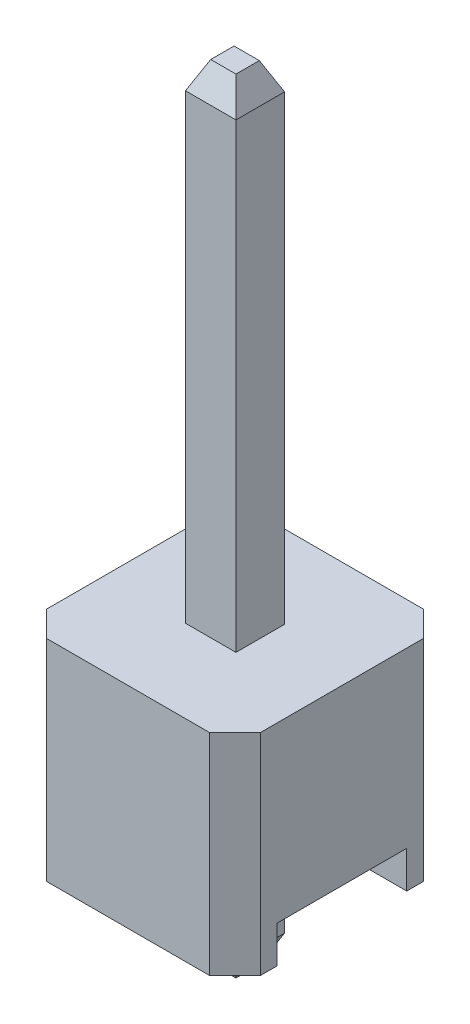
ISO-10303-21;
HEADER;
FILE_DESCRIPTION(('STEP AP214'),'2;1');
FILE_NAME('part.step','',(''),(''),'','','');
FILE_SCHEMA(('AUTOMOTIVE_DESIGN { 1 0 10303 214 1 1 1 1 }'));
ENDSEC;
DATA;
#1=APPLICATION_CONTEXT('core data for automotive mechanical design processes');
#2=APPLICATION_PROTOCOL_DEFINITION('international standard','automotive_design',2000,#1);
#3=PRODUCT_CONTEXT('',#1,'mechanical');
#4=PRODUCT('Part','Part','',(#3));
#5=PRODUCT_RELATED_PRODUCT_CATEGORY('part','',(#4));
#6=PRODUCT_DEFINITION_FORMATION('','',#4);
#7=PRODUCT_DEFINITION_CONTEXT('part definition',#1,'design');
#8=PRODUCT_DEFINITION('design','',#6,#7);
#9=PRODUCT_DEFINITION_SHAPE('','',#8);
#10=(LENGTH_UNIT() NAMED_UNIT(*) SI_UNIT(.MILLI.,.METRE.));
#11=(NAMED_UNIT(*) PLANE_ANGLE_UNIT() SI_UNIT($,.RADIAN.));
#12=(NAMED_UNIT(*) SI_UNIT($,.STERADIAN.) SOLID_ANGLE_UNIT());
#13=UNCERTAINTY_MEASURE_WITH_UNIT(LENGTH_MEASURE(1.E-05),#10,'distance_accuracy_value','');
#14=(GEOMETRIC_REPRESENTATION_CONTEXT(3) GLOBAL_UNCERTAINTY_ASSIGNED_CONTEXT((#13)) GLOBAL_UNIT_ASSIGNED_CONTEXT((#10,
#11,#12)) REPRESENTATION_CONTEXT('',''));
#15=CARTESIAN_POINT('',(0.,0.,0.));
#16=DIRECTION('',(0.,0.,1.));
#17=DIRECTION('',(1.,0.,0.));
#18=AXIS2_PLACEMENT_3D('',#15,#16,#17);
#19=CARTESIAN_POINT('',(15.6674969604626,-5.69124998633488,-0.267125953881934));
#20=DIRECTION('',(0.,-1.,0.));
#21=DIRECTION('',(0.,0.,-1.));
#22=AXIS2_PLACEMENT_3D('',#19,#20,#21);
#23=PLANE('',#22);
#24=DIRECTION('',(1.,0.,0.));
#25=VECTOR('',#24,1.);
#26=CARTESIAN_POINT('',(15.0674969604626,-5.69124998633488,-0.117125953881934));
#27=LINE('',#26,#25);
#28=CARTESIAN_POINT('',(15.2174969604626,-5.69124998633488,-0.117125953881935));
#29=VERTEX_POINT('',#28);
#30=CARTESIAN_POINT('',(15.5174969604626,-5.69124998633488,-0.117125953881935));
#31=VERTEX_POINT('',#30);
#32=EDGE_CURVE('E194',#29,#31,#27,.T.);
#33=ORIENTED_EDGE('',*,*,#32,.T.);
#34=DIRECTION('',(0.,0.,1.));
#35=VECTOR('',#34,1.);
#36=CARTESIAN_POINT('',(15.5174969604626,-5.69124998633488,-0.267125953881934));
#37=LINE('',#36,#35);
#38=CARTESIAN_POINT('',(15.5174969604626,-5.69124998633488,0.160380176225975));
#39=VERTEX_POINT('',#38);
#40=EDGE_CURVE('E179',#31,#39,#37,.T.);
#41=ORIENTED_EDGE('',*,*,#40,.T.);
#42=DIRECTION('',(1.,0.,0.));
#43=VECTOR('',#42,1.);
#44=CARTESIAN_POINT('',(15.6674969604626,-5.69124998633488,0.160380176225975));
#45=LINE('',#44,#43);
#46=CARTESIAN_POINT('',(15.2174969604626,-5.69124998633488,0.160380176225975));
#47=VERTEX_POINT('',#46);
#48=EDGE_CURVE('E20',#39,#47,#45,.F.);
#49=ORIENTED_EDGE('',*,*,#48,.T.);
#50=DIRECTION('',(0.,0.,1.));
#51=VECTOR('',#50,1.);
#52=CARTESIAN_POINT('',(15.2174969604626,-5.69124998633488,0.310380176225974));
#53=LINE('',#52,#51);
#54=EDGE_CURVE('E174',#47,#29,#53,.F.);
#55=ORIENTED_EDGE('',*,*,#54,.T.);
#56=EDGE_LOOP('',(#33,#41,#49,#55));
#57=FACE_BOUND('',#56,.T.);
#58=ADVANCED_FACE('F17',(#57),#23,.T.);
#59=CARTESIAN_POINT('',(15.6674969604626,-5.36957394825845,0.310380176225975));
#60=DIRECTION('',(0.,0.4226182617407,-0.90630778703665));
#61=DIRECTION('',(0.,0.90630778703665,0.4226182617407));
#62=AXIS2_PLACEMENT_3D('',#59,#60,#61);
#63=PLANE('',#62);
#64=DIRECTION('',(1.,0.,0.));
#65=VECTOR('',#64,1.);
#66=CARTESIAN_POINT('',(15.6674969604626,-5.36957394825845,0.310380176225975));
#67=LINE('',#66,#65);
#68=CARTESIAN_POINT('',(15.0674969604626,-5.36957394825845,0.310380176225975));
#69=VERTEX_POINT('',#68);
#70=CARTESIAN_POINT('',(15.6674969604626,-5.36957394825845,0.310380176225975));
#71=VERTEX_POINT('',#70);
#72=EDGE_CURVE('E186',#69,#71,#67,.T.);
#73=ORIENTED_EDGE('',*,*,#72,.F.);
#74=DIRECTION('',(0.389281620635028,-0.834817129478988,-0.389281620635023));
#75=VECTOR('',#74,1.);
#76=CARTESIAN_POINT('',(15.0674969604626,-5.36957394825845,0.310380176225974));
#77=LINE('',#76,#75);
#78=EDGE_CURVE('E182',#69,#47,#77,.T.);
#79=ORIENTED_EDGE('',*,*,#78,.T.);
#80=ORIENTED_EDGE('',*,*,#48,.F.);
#81=DIRECTION('',(0.389281620635027,0.834817129478987,0.389281620635025));
#82=VECTOR('',#81,1.);
#83=CARTESIAN_POINT('',(15.5174969604626,-5.69124998633488,0.160380176225975));
#84=LINE('',#83,#82);
#85=EDGE_CURVE('E202',#39,#71,#84,.T.);
#86=ORIENTED_EDGE('',*,*,#85,.T.);
#87=EDGE_LOOP('',(#73,#79,#80,#86));
#88=FACE_BOUND('',#87,.T.);
#89=ADVANCED_FACE('F184',(#88),#63,.F.);
#90=CARTESIAN_POINT('',(15.0674969604626,-5.36957394825845,0.310380176225974));
#91=DIRECTION('',(0.906307787036649,0.422618261740701,0.));
#92=DIRECTION('',(-0.422618261740701,0.906307787036649,0.));
#93=AXIS2_PLACEMENT_3D('',#90,#91,#92);
#94=PLANE('',#93);
#95=ORIENTED_EDGE('',*,*,#54,.F.);
#96=ORIENTED_EDGE('',*,*,#78,.F.);
#97=DIRECTION('',(0.,0.,1.));
#98=VECTOR('',#97,1.);
#99=CARTESIAN_POINT('',(15.0674969604626,-5.36957394825845,0.310380176225974));
#100=LINE('',#99,#98);
#101=CARTESIAN_POINT('',(15.0674969604626,-5.36957394825845,-0.267125953881935));
#102=VERTEX_POINT('',#101);
#103=EDGE_CURVE('E205',#102,#69,#100,.T.);
#104=ORIENTED_EDGE('',*,*,#103,.F.);
#105=DIRECTION('',(0.389281620635027,-0.834817129478986,0.389281620635026));
#106=VECTOR('',#105,1.);
#107=CARTESIAN_POINT('',(15.0674969604626,-5.36957394825845,-0.267125953881935));
#108=LINE('',#107,#106);
#109=EDGE_CURVE('E191',#102,#29,#108,.T.);
#110=ORIENTED_EDGE('',*,*,#109,.T.);
#111=EDGE_LOOP('',(#95,#96,#104,#110));
#112=FACE_BOUND('',#111,.T.);
#113=ADVANCED_FACE('F189',(#112),#94,.F.);
#114=CARTESIAN_POINT('',(15.0674969604626,-5.36957394825845,-0.267125953881935));
#115=DIRECTION('',(0.,0.422618261740701,0.906307787036649));
#116=DIRECTION('',(0.,-0.906307787036649,0.422618261740701));
#117=AXIS2_PLACEMENT_3D('',#114,#115,#116);
#118=PLANE('',#117);
#119=ORIENTED_EDGE('',*,*,#32,.F.);
#120=ORIENTED_EDGE('',*,*,#109,.F.);
#121=DIRECTION('',(-1.,0.,0.));
#122=VECTOR('',#121,1.);
#123=CARTESIAN_POINT('',(15.0674969604626,-5.36957394825845,-0.267125953881935));
#124=LINE('',#123,#122);
#125=CARTESIAN_POINT('',(15.6674969604626,-5.36957394825845,-0.267125953881934));
#126=VERTEX_POINT('',#125);
#127=EDGE_CURVE('E211',#126,#102,#124,.T.);
#128=ORIENTED_EDGE('',*,*,#127,.F.);
#129=DIRECTION('',(-0.389281620635028,-0.834817129478988,0.389281620635023));
#130=VECTOR('',#129,1.);
#131=CARTESIAN_POINT('',(15.6674969604626,-5.36957394825845,-0.267125953881934));
#132=LINE('',#131,#130);
#133=EDGE_CURVE('E198',#126,#31,#132,.T.);
#134=ORIENTED_EDGE('',*,*,#133,.T.);
#135=EDGE_LOOP('',(#119,#120,#128,#134));
#136=FACE_BOUND('',#135,.T.);
#137=ADVANCED_FACE('F518',(#136),#118,.F.);
#138=CARTESIAN_POINT('',(15.6674969604626,-5.36957394825845,-0.267125953881934));
#139=DIRECTION('',(-0.906307787036649,0.422618261740701,0.));
#140=DIRECTION('',(-0.422618261740701,-0.906307787036649,0.));
#141=AXIS2_PLACEMENT_3D('',#138,#139,#140);
#142=PLANE('',#141);
#143=ORIENTED_EDGE('',*,*,#40,.F.);
#144=ORIENTED_EDGE('',*,*,#133,.F.);
#145=DIRECTION('',(0.,0.,-1.));
#146=VECTOR('',#145,1.);
#147=CARTESIAN_POINT('',(15.6674969604626,-5.36957394825845,-0.267125953881934));
#148=LINE('',#147,#146);
#149=EDGE_CURVE('E220',#71,#126,#148,.T.);
#150=ORIENTED_EDGE('',*,*,#149,.F.);
#151=ORIENTED_EDGE('',*,*,#85,.F.);
#152=EDGE_LOOP('',(#143,#144,#150,#151));
#153=FACE_BOUND('',#152,.T.);
#154=ADVANCED_FACE('F514',(#153),#142,.F.);
#155=CARTESIAN_POINT('',(15.6674969604626,-5.69124998633488,0.310380176225975));
#156=DIRECTION('',(0.,0.,1.));
#157=DIRECTION('',(1.,0.,0.));
#158=AXIS2_PLACEMENT_3D('',#155,#156,#157);
#159=PLANE('',#158);
#160=DIRECTION('',(0.,1.,0.));
#161=VECTOR('',#160,1.);
#162=CARTESIAN_POINT('',(15.6674969604626,-5.69124998633488,0.310380176225975));
#163=LINE('',#162,#161);
#164=CARTESIAN_POINT('',(15.6674969604626,-4.25124998633488,0.310380176225975));
#165=VERTEX_POINT('',#164);
#166=EDGE_CURVE('E217',#165,#71,#163,.F.);
#167=ORIENTED_EDGE('',*,*,#166,.F.);
#168=DIRECTION('',(1.,0.,0.));
#169=VECTOR('',#168,1.);
#170=CARTESIAN_POINT('',(14.0974969604626,-4.25124998633488,0.310380176225975));
#171=LINE('',#170,#169);
#172=CARTESIAN_POINT('',(15.0674969604626,-4.25124998633488,0.310380176225975));
#173=VERTEX_POINT('',#172);
#174=EDGE_CURVE('E230',#165,#173,#171,.F.);
#175=ORIENTED_EDGE('',*,*,#174,.T.);
#176=DIRECTION('',(0.,1.,0.));
#177=VECTOR('',#176,1.);
#178=CARTESIAN_POINT('',(15.0674969604626,-5.69124998633488,0.310380176225974));
#179=LINE('',#178,#177);
#180=EDGE_CURVE('E208',#69,#173,#179,.T.);
#181=ORIENTED_EDGE('',*,*,#180,.F.);
#182=ORIENTED_EDGE('',*,*,#72,.T.);
#183=EDGE_LOOP('',(#167,#175,#181,#182));
#184=FACE_BOUND('',#183,.T.);
#185=ADVANCED_FACE('F510',(#184),#159,.T.);
#186=CARTESIAN_POINT('',(15.0674969604626,-5.69124998633488,0.310380176225974));
#187=DIRECTION('',(-1.,0.,0.));
#188=DIRECTION('',(0.,0.,1.));
#189=AXIS2_PLACEMENT_3D('',#186,#187,#188);
#190=PLANE('',#189);
#191=ORIENTED_EDGE('',*,*,#180,.T.);
#192=DIRECTION('',(0.,0.,1.));
#193=VECTOR('',#192,1.);
#194=CARTESIAN_POINT('',(15.0674969604626,-4.25124998633488,0.791627111172019));
#195=LINE('',#194,#193);
#196=CARTESIAN_POINT('',(15.0674969604626,-4.25124998633488,-0.267125953881935));
#197=VERTEX_POINT('',#196);
#198=EDGE_CURVE('E232',#173,#197,#195,.F.);
#199=ORIENTED_EDGE('',*,*,#198,.T.);
#200=DIRECTION('',(0.,1.,0.));
#201=VECTOR('',#200,1.);
#202=CARTESIAN_POINT('',(15.0674969604626,-5.69124998633488,-0.267125953881935));
#203=LINE('',#202,#201);
#204=EDGE_CURVE('E214',#102,#197,#203,.T.);
#205=ORIENTED_EDGE('',*,*,#204,.F.);
#206=ORIENTED_EDGE('',*,*,#103,.T.);
#207=EDGE_LOOP('',(#191,#199,#205,#206));
#208=FACE_BOUND('',#207,.T.);
#209=ADVANCED_FACE('F506',(#208),#190,.T.);
#210=CARTESIAN_POINT('',(15.0674969604626,-5.69124998633488,-0.267125953881935));
#211=DIRECTION('',(0.,0.,-1.));
#212=DIRECTION('',(-1.,0.,0.));
#213=AXIS2_PLACEMENT_3D('',#210,#211,#212);
#214=PLANE('',#213);
#215=ORIENTED_EDGE('',*,*,#204,.T.);
#216=DIRECTION('',(1.,0.,0.));
#217=VECTOR('',#216,1.);
#218=CARTESIAN_POINT('',(14.0974969604626,-4.25124998633488,-0.267125953881935));
#219=LINE('',#218,#217);
#220=CARTESIAN_POINT('',(15.6674969604626,-4.25124998633488,-0.267125953881935));
#221=VERTEX_POINT('',#220);
#222=EDGE_CURVE('E234',#197,#221,#219,.T.);
#223=ORIENTED_EDGE('',*,*,#222,.T.);
#224=DIRECTION('',(0.,1.,0.));
#225=VECTOR('',#224,1.);
#226=CARTESIAN_POINT('',(15.6674969604626,-5.69124998633488,-0.267125953881934));
#227=LINE('',#226,#225);
#228=EDGE_CURVE('E223',#126,#221,#227,.T.);
#229=ORIENTED_EDGE('',*,*,#228,.F.);
#230=ORIENTED_EDGE('',*,*,#127,.T.);
#231=EDGE_LOOP('',(#215,#223,#229,#230));
#232=FACE_BOUND('',#231,.T.);
#233=ADVANCED_FACE('F502',(#232),#214,.T.);
#234=CARTESIAN_POINT('',(15.6674969604626,-5.69124998633488,-0.267125953881934));
#235=DIRECTION('',(1.,0.,0.));
#236=DIRECTION('',(0.,0.,-1.));
#237=AXIS2_PLACEMENT_3D('',#234,#235,#236);
#238=PLANE('',#237);
#239=ORIENTED_EDGE('',*,*,#228,.T.);
#240=DIRECTION('',(0.,0.,1.));
#241=VECTOR('',#240,1.);
#242=CARTESIAN_POINT('',(15.6674969604626,-4.25124998633488,0.791627111172019));
#243=LINE('',#242,#241);
#244=EDGE_CURVE('E236',#221,#165,#243,.T.);
#245=ORIENTED_EDGE('',*,*,#244,.T.);
#246=ORIENTED_EDGE('',*,*,#166,.T.);
#247=ORIENTED_EDGE('',*,*,#149,.T.);
#248=EDGE_LOOP('',(#239,#245,#246,#247));
#249=FACE_BOUND('',#248,.T.);
#250=ADVANCED_FACE('F498',(#249),#238,.T.);
#251=CARTESIAN_POINT('',(14.0974969604626,-4.25124998633488,0.791627111172019));
#252=DIRECTION('',(0.,1.,0.));
#253=DIRECTION('',(0.,0.,1.));
#254=AXIS2_PLACEMENT_3D('',#251,#252,#253);
#255=PLANE('',#254);
#256=ORIENTED_EDGE('',*,*,#222,.F.);
#257=ORIENTED_EDGE('',*,*,#198,.F.);
#258=ORIENTED_EDGE('',*,*,#174,.F.);
#259=ORIENTED_EDGE('',*,*,#244,.F.);
#260=EDGE_LOOP('',(#256,#257,#258,#259));
#261=FACE_BOUND('',#260,.T.);
#262=DIRECTION('',(-1.,0.,0.));
#263=VECTOR('',#262,1.);
#264=CARTESIAN_POINT('',(14.0974969604626,-4.25124998633488,-0.748372888827982));
#265=LINE('',#264,#263);
#266=CARTESIAN_POINT('',(14.0974969604626,-4.25124998633488,-0.748372888827981));
#267=VERTEX_POINT('',#266);
#268=CARTESIAN_POINT('',(16.6374969604626,-4.25124998633488,-0.74837288882798));
#269=VERTEX_POINT('',#268);
#270=EDGE_CURVE('E241',#267,#269,#265,.F.);
#271=ORIENTED_EDGE('',*,*,#270,.T.);
#272=DIRECTION('',(0.,0.,1.));
#273=VECTOR('',#272,1.);
#274=CARTESIAN_POINT('',(16.6374969604626,-4.25124998633488,0.791627111172019));
#275=LINE('',#274,#273);
#276=CARTESIAN_POINT('',(16.6374969604626,-4.25124998633488,0.79162711117202));
#277=VERTEX_POINT('',#276);
#278=EDGE_CURVE('E226',#277,#269,#275,.F.);
#279=ORIENTED_EDGE('',*,*,#278,.F.);
#280=DIRECTION('',(1.,0.,0.));
#281=VECTOR('',#280,1.);
#282=CARTESIAN_POINT('',(14.0974969604626,-4.25124998633488,0.791627111172019));
#283=LINE('',#282,#281);
#284=CARTESIAN_POINT('',(14.0974969604626,-4.25124998633488,0.791627111172019));
#285=VERTEX_POINT('',#284);
#286=EDGE_CURVE('E248',#277,#285,#283,.F.);
#287=ORIENTED_EDGE('',*,*,#286,.T.);
#288=DIRECTION('',(0.,0.,1.));
#289=VECTOR('',#288,1.);
#290=CARTESIAN_POINT('',(14.0974969604626,-4.25124998633488,0.791627111172019));
#291=LINE('',#290,#289);
#292=EDGE_CURVE('E228',#267,#285,#291,.T.);
#293=ORIENTED_EDGE('',*,*,#292,.F.);
#294=EDGE_LOOP('',(#271,#279,#287,#293));
#295=FACE_BOUND('',#294,.T.);
#296=ADVANCED_FACE('F495',(#261,#295),#255,.F.);
#297=CARTESIAN_POINT('',(15.5174969604626,3.60875001366512,-0.267125953881934));
#298=DIRECTION('',(0.906307787036651,0.422618261740697,0.));
#299=DIRECTION('',(-0.422618261740697,0.906307787036651,0.));
#300=AXIS2_PLACEMENT_3D('',#297,#298,#299);
#301=PLANE('',#300);
#302=DIRECTION('',(0.389281620635025,-0.834817129478989,-0.389281620635023));
#303=VECTOR('',#302,1.);
#304=CARTESIAN_POINT('',(15.5174969604626,3.60875001366512,-0.117125953881934));
#305=LINE('',#304,#303);
#306=CARTESIAN_POINT('',(15.5174969604626,3.60875001366512,-0.117125953881935));
#307=VERTEX_POINT('',#306);
#308=CARTESIAN_POINT('',(15.6674969604626,3.28707397558869,-0.267125953881934));
#309=VERTEX_POINT('',#308);
#310=EDGE_CURVE('E263',#307,#309,#305,.T.);
#311=ORIENTED_EDGE('',*,*,#310,.F.);
#312=DIRECTION('',(0.,0.,-1.));
#313=VECTOR('',#312,1.);
#314=CARTESIAN_POINT('',(15.5174969604626,3.60875001366512,-0.267125953881934));
#315=LINE('',#314,#313);
#316=CARTESIAN_POINT('',(15.5174969604626,3.60875001366512,0.160380176225975));
#317=VERTEX_POINT('',#316);
#318=EDGE_CURVE('E256',#307,#317,#315,.F.);
#319=ORIENTED_EDGE('',*,*,#318,.T.);
#320=DIRECTION('',(-0.389281620635024,0.834817129478989,-0.389281620635023));
#321=VECTOR('',#320,1.);
#322=CARTESIAN_POINT('',(15.6674969604626,3.28707397558869,0.310380176225975));
#323=LINE('',#322,#321);
#324=CARTESIAN_POINT('',(15.6674969604626,3.28707397558869,0.310380176225975));
#325=VERTEX_POINT('',#324);
#326=EDGE_CURVE('E253',#325,#317,#323,.T.);
#327=ORIENTED_EDGE('',*,*,#326,.F.);
#328=DIRECTION('',(0.,0.,-1.));
#329=VECTOR('',#328,1.);
#330=CARTESIAN_POINT('',(15.6674969604626,3.28707397558869,-0.267125953881934));
#331=LINE('',#330,#329);
#332=EDGE_CURVE('E266',#309,#325,#331,.F.);
#333=ORIENTED_EDGE('',*,*,#332,.F.);
#334=EDGE_LOOP('',(#311,#319,#327,#333));
#335=FACE_BOUND('',#334,.T.);
#336=ADVANCED_FACE('F472',(#335),#301,.T.);
#337=CARTESIAN_POINT('',(14.0974969604626,-4.25124998633488,-0.748372888827982));
#338=DIRECTION('',(0.,0.,-1.));
#339=DIRECTION('',(-1.,0.,0.));
#340=AXIS2_PLACEMENT_3D('',#337,#338,#339);
#341=PLANE('',#340);
#342=DIRECTION('',(0.,1.,0.));
#343=VECTOR('',#342,1.);
#344=CARTESIAN_POINT('',(16.6374969604626,-4.25124998633488,-0.748372888827982));
#345=LINE('',#344,#343);
#346=CARTESIAN_POINT('',(16.6374969604626,-4.69124998633488,-0.748372888827981));
#347=VERTEX_POINT('',#346);
#348=EDGE_CURVE('E244',#269,#347,#345,.F.);
#349=ORIENTED_EDGE('',*,*,#348,.F.);
#350=ORIENTED_EDGE('',*,*,#270,.F.);
#351=DIRECTION('',(0.,1.,0.));
#352=VECTOR('',#351,1.);
#353=CARTESIAN_POINT('',(14.0974969604626,-4.25124998633488,-0.748372888827982));
#354=LINE('',#353,#352);
#355=CARTESIAN_POINT('',(14.0974969604626,-4.69124998633488,-0.748372888827982));
#356=VERTEX_POINT('',#355);
#357=EDGE_CURVE('E239',#356,#267,#354,.T.);
#358=ORIENTED_EDGE('',*,*,#357,.F.);
#359=DIRECTION('',(1.,0.,0.));
#360=VECTOR('',#359,1.);
#361=CARTESIAN_POINT('',(15.3674969604626,-4.69124998633488,-0.748372888827981));
#362=LINE('',#361,#360);
#363=EDGE_CURVE('E273',#356,#347,#362,.T.);
#364=ORIENTED_EDGE('',*,*,#363,.T.);
#365=EDGE_LOOP('',(#349,#350,#358,#364));
#366=FACE_BOUND('',#365,.T.);
#367=ADVANCED_FACE('F488',(#366),#341,.F.);
#368=CARTESIAN_POINT('',(14.0974969604626,-4.25124998633488,0.791627111172019));
#369=DIRECTION('',(0.,0.,1.));
#370=DIRECTION('',(1.,0.,0.));
#371=AXIS2_PLACEMENT_3D('',#368,#369,#370);
#372=PLANE('',#371);
#373=DIRECTION('',(0.,1.,0.));
#374=VECTOR('',#373,1.);
#375=CARTESIAN_POINT('',(14.0974969604626,-4.25124998633488,0.791627111172019));
#376=LINE('',#375,#374);
#377=CARTESIAN_POINT('',(14.0974969604626,-4.69124998633488,0.79162711117202));
#378=VERTEX_POINT('',#377);
#379=EDGE_CURVE('E251',#285,#378,#376,.F.);
#380=ORIENTED_EDGE('',*,*,#379,.F.);
#381=ORIENTED_EDGE('',*,*,#286,.F.);
#382=DIRECTION('',(0.,1.,0.));
#383=VECTOR('',#382,1.);
#384=CARTESIAN_POINT('',(16.6374969604626,-4.25124998633488,0.791627111172019));
#385=LINE('',#384,#383);
#386=CARTESIAN_POINT('',(16.6374969604626,-4.69124998633488,0.791627111172021));
#387=VERTEX_POINT('',#386);
#388=EDGE_CURVE('E246',#387,#277,#385,.T.);
#389=ORIENTED_EDGE('',*,*,#388,.F.);
#390=DIRECTION('',(1.,0.,0.));
#391=VECTOR('',#390,1.);
#392=CARTESIAN_POINT('',(15.3674969604626,-4.69124998633488,0.791627111172021));
#393=LINE('',#392,#391);
#394=EDGE_CURVE('E288',#387,#378,#393,.F.);
#395=ORIENTED_EDGE('',*,*,#394,.T.);
#396=EDGE_LOOP('',(#380,#381,#389,#395));
#397=FACE_BOUND('',#396,.T.);
#398=ADVANCED_FACE('F482',(#397),#372,.F.);
#399=CARTESIAN_POINT('',(15.6674969604626,3.60875001366512,0.160380176225975));
#400=DIRECTION('',(0.,0.422618261740697,0.906307787036651));
#401=DIRECTION('',(0.,-0.906307787036651,0.422618261740697));
#402=AXIS2_PLACEMENT_3D('',#399,#400,#401);
#403=PLANE('',#402);
#404=ORIENTED_EDGE('',*,*,#326,.T.);
#405=DIRECTION('',(1.,0.,0.));
#406=VECTOR('',#405,1.);
#407=CARTESIAN_POINT('',(15.6674969604626,3.60875001366512,0.160380176225975));
#408=LINE('',#407,#406);
#409=CARTESIAN_POINT('',(15.2174969604626,3.60875001366512,0.160380176225975));
#410=VERTEX_POINT('',#409);
#411=EDGE_CURVE('E258',#317,#410,#408,.F.);
#412=ORIENTED_EDGE('',*,*,#411,.T.);
#413=DIRECTION('',(0.389281620635025,0.83481712947899,-0.38928162063502));
#414=VECTOR('',#413,1.);
#415=CARTESIAN_POINT('',(15.0674969604626,3.28707397558869,0.310380176225974));
#416=LINE('',#415,#414);
#417=CARTESIAN_POINT('',(15.0674969604626,3.28707397558869,0.310380176225975));
#418=VERTEX_POINT('',#417);
#419=EDGE_CURVE('E310',#418,#410,#416,.T.);
#420=ORIENTED_EDGE('',*,*,#419,.F.);
#421=DIRECTION('',(1.,0.,0.));
#422=VECTOR('',#421,1.);
#423=CARTESIAN_POINT('',(15.6674969604626,3.28707397558869,0.310380176225975));
#424=LINE('',#423,#422);
#425=EDGE_CURVE('E303',#325,#418,#424,.F.);
#426=ORIENTED_EDGE('',*,*,#425,.F.);
#427=EDGE_LOOP('',(#404,#412,#420,#426));
#428=FACE_BOUND('',#427,.T.);
#429=ADVANCED_FACE('F466',(#428),#403,.T.);
#430=CARTESIAN_POINT('',(15.6674969604626,3.60875001366512,-0.267125953881934));
#431=DIRECTION('',(0.,-1.,0.));
#432=DIRECTION('',(0.,0.,-1.));
#433=AXIS2_PLACEMENT_3D('',#430,#431,#432);
#434=PLANE('',#433);
#435=ORIENTED_EDGE('',*,*,#318,.F.);
#436=DIRECTION('',(1.,0.,0.));
#437=VECTOR('',#436,1.);
#438=CARTESIAN_POINT('',(15.6674969604626,3.60875001366512,-0.117125953881934));
#439=LINE('',#438,#437);
#440=CARTESIAN_POINT('',(15.2174969604626,3.60875001366512,-0.117125953881935));
#441=VERTEX_POINT('',#440);
#442=EDGE_CURVE('E260',#441,#307,#439,.T.);
#443=ORIENTED_EDGE('',*,*,#442,.F.);
#444=DIRECTION('',(0.,0.,1.));
#445=VECTOR('',#444,1.);
#446=CARTESIAN_POINT('',(15.2174969604626,3.60875001366512,-0.267125953881934));
#447=LINE('',#446,#445);
#448=EDGE_CURVE('E313',#410,#441,#447,.F.);
#449=ORIENTED_EDGE('',*,*,#448,.F.);
#450=ORIENTED_EDGE('',*,*,#411,.F.);
#451=EDGE_LOOP('',(#435,#443,#449,#450));
#452=FACE_BOUND('',#451,.T.);
#453=ADVANCED_FACE('F474',(#452),#434,.F.);
#454=CARTESIAN_POINT('',(15.6674969604626,3.60875001366512,-0.117125953881934));
#455=DIRECTION('',(0.,0.422618261740697,-0.906307787036651));
#456=DIRECTION('',(0.,0.906307787036651,0.422618261740697));
#457=AXIS2_PLACEMENT_3D('',#454,#455,#456);
#458=PLANE('',#457);
#459=ORIENTED_EDGE('',*,*,#310,.T.);
#460=DIRECTION('',(-1.,0.,0.));
#461=VECTOR('',#460,1.);
#462=CARTESIAN_POINT('',(15.0674969604626,3.28707397558869,-0.267125953881935));
#463=LINE('',#462,#461);
#464=CARTESIAN_POINT('',(15.0674969604626,3.28707397558869,-0.267125953881935));
#465=VERTEX_POINT('',#464);
#466=EDGE_CURVE('E316',#465,#309,#463,.F.);
#467=ORIENTED_EDGE('',*,*,#466,.F.);
#468=DIRECTION('',(-0.389281620635024,-0.83481712947899,-0.389281620635022));
#469=VECTOR('',#468,1.);
#470=CARTESIAN_POINT('',(15.2174969604626,3.60875001366512,-0.117125953881935));
#471=LINE('',#470,#469);
#472=EDGE_CURVE('E307',#441,#465,#471,.T.);
#473=ORIENTED_EDGE('',*,*,#472,.F.);
#474=ORIENTED_EDGE('',*,*,#442,.T.);
#475=EDGE_LOOP('',(#459,#467,#473,#474));
#476=FACE_BOUND('',#475,.T.);
#477=ADVANCED_FACE('F471',(#476),#458,.T.);
#478=CARTESIAN_POINT('',(15.6674969604626,-5.69124998633488,-0.267125953881934));
#479=DIRECTION('',(1.,0.,0.));
#480=DIRECTION('',(0.,0.,-1.));
#481=AXIS2_PLACEMENT_3D('',#478,#479,#480);
#482=PLANE('',#481);
#483=DIRECTION('',(0.,1.,0.));
#484=VECTOR('',#483,1.);
#485=CARTESIAN_POINT('',(15.6674969604626,-5.69124998633488,0.310380176225975));
#486=LINE('',#485,#484);
#487=CARTESIAN_POINT('',(15.6674969604626,-2.19124998633488,0.310380176225975));
#488=VERTEX_POINT('',#487);
#489=EDGE_CURVE('E300',#488,#325,#486,.T.);
#490=ORIENTED_EDGE('',*,*,#489,.F.);
#491=DIRECTION('',(0.,0.,-1.));
#492=VECTOR('',#491,1.);
#493=CARTESIAN_POINT('',(15.6674969604626,-2.19124998633488,-0.267125953881934));
#494=LINE('',#493,#492);
#495=CARTESIAN_POINT('',(15.6674969604626,-2.19124998633488,-0.267125953881934));
#496=VERTEX_POINT('',#495);
#497=EDGE_CURVE('E269',#488,#496,#494,.T.);
#498=ORIENTED_EDGE('',*,*,#497,.T.);
#499=DIRECTION('',(0.,1.,0.));
#500=VECTOR('',#499,1.);
#501=CARTESIAN_POINT('',(15.6674969604626,-5.69124998633488,-0.267125953881935));
#502=LINE('',#501,#500);
#503=EDGE_CURVE('E319',#309,#496,#502,.F.);
#504=ORIENTED_EDGE('',*,*,#503,.F.);
#505=ORIENTED_EDGE('',*,*,#332,.T.);
#506=EDGE_LOOP('',(#490,#498,#504,#505));
#507=FACE_BOUND('',#506,.T.);
#508=ADVANCED_FACE('F462',(#507),#482,.T.);
#509=CARTESIAN_POINT('',(15.3674969604626,-4.69124998633488,-2.21837288882799));
#510=DIRECTION('',(0.,1.,0.));
#511=DIRECTION('',(0.,0.,1.));
#512=AXIS2_PLACEMENT_3D('',#509,#510,#511);
#513=PLANE('',#512);
#514=ORIENTED_EDGE('',*,*,#363,.F.);
#515=DIRECTION('',(0.,0.,1.));
#516=VECTOR('',#515,1.);
#517=CARTESIAN_POINT('',(14.0974969604626,-4.69124998633488,-2.21837288882799));
#518=LINE('',#517,#516);
#519=CARTESIAN_POINT('',(14.0974969604626,-4.69124998633488,-0.948372888827982));
#520=VERTEX_POINT('',#519);
#521=EDGE_CURVE('E271',#520,#356,#518,.T.);
#522=ORIENTED_EDGE('',*,*,#521,.F.);
#523=DIRECTION('',(0.707106781186547,0.,-0.707106781186548));
#524=VECTOR('',#523,1.);
#525=CARTESIAN_POINT('',(14.3974969604626,-4.69124998633488,-1.24837288882798));
#526=LINE('',#525,#524);
#527=CARTESIAN_POINT('',(14.3974969604626,-4.69124998633488,-1.24837288882798));
#528=VERTEX_POINT('',#527);
#529=EDGE_CURVE('E280',#520,#528,#526,.T.);
#530=ORIENTED_EDGE('',*,*,#529,.T.);
#531=DIRECTION('',(1.,0.,0.));
#532=VECTOR('',#531,1.);
#533=CARTESIAN_POINT('',(16.3374969604626,-4.69124998633488,-1.24837288882798));
#534=LINE('',#533,#532);
#535=CARTESIAN_POINT('',(16.3374969604626,-4.69124998633488,-1.24837288882798));
#536=VERTEX_POINT('',#535);
#537=EDGE_CURVE('E330',#528,#536,#534,.T.);
#538=ORIENTED_EDGE('',*,*,#537,.T.);
#539=DIRECTION('',(0.707106781186546,0.,0.707106781186549));
#540=VECTOR('',#539,1.);
#541=CARTESIAN_POINT('',(16.6374969604626,-4.69124998633488,-0.94837288882798));
#542=LINE('',#541,#540);
#543=CARTESIAN_POINT('',(16.6374969604626,-4.69124998633488,-0.94837288882798));
#544=VERTEX_POINT('',#543);
#545=EDGE_CURVE('E297',#536,#544,#542,.T.);
#546=ORIENTED_EDGE('',*,*,#545,.T.);
#547=DIRECTION('',(0.,0.,1.));
#548=VECTOR('',#547,1.);
#549=CARTESIAN_POINT('',(16.6374969604626,-4.69124998633488,-2.21837288882799));
#550=LINE('',#549,#548);
#551=EDGE_CURVE('E276',#347,#544,#550,.F.);
#552=ORIENTED_EDGE('',*,*,#551,.F.);
#553=EDGE_LOOP('',(#514,#522,#530,#538,#546,#552));
#554=FACE_BOUND('',#553,.T.);
#555=ADVANCED_FACE('F630',(#554),#513,.F.);
#556=CARTESIAN_POINT('',(14.3974969604626,-2.19124998633488,-1.24837288882798));
#557=DIRECTION('',(0.707106781186548,0.,0.707106781186547));
#558=DIRECTION('',(0.707106781186547,0.,-0.707106781186548));
#559=AXIS2_PLACEMENT_3D('',#556,#557,#558);
#560=PLANE('',#559);
#561=DIRECTION('',(0.,1.,0.));
#562=VECTOR('',#561,1.);
#563=CARTESIAN_POINT('',(14.0974969604626,-2.19124998633488,-0.948372888827982));
#564=LINE('',#563,#562);
#565=CARTESIAN_POINT('',(14.0974969604626,-2.19124998633488,-0.948372888827983));
#566=VERTEX_POINT('',#565);
#567=EDGE_CURVE('E333',#520,#566,#564,.T.);
#568=ORIENTED_EDGE('',*,*,#567,.T.);
#569=DIRECTION('',(0.707106781186547,0.,-0.707106781186548));
#570=VECTOR('',#569,1.);
#571=CARTESIAN_POINT('',(14.3974969604626,-2.19124998633488,-1.24837288882798));
#572=LINE('',#571,#570);
#573=CARTESIAN_POINT('',(14.3974969604626,-2.19124998633488,-1.24837288882798));
#574=VERTEX_POINT('',#573);
#575=EDGE_CURVE('E278',#574,#566,#572,.F.);
#576=ORIENTED_EDGE('',*,*,#575,.F.);
#577=DIRECTION('',(0.,1.,0.));
#578=VECTOR('',#577,1.);
#579=CARTESIAN_POINT('',(14.3974969604626,-2.19124998633488,-1.24837288882798));
#580=LINE('',#579,#578);
#581=EDGE_CURVE('E327',#574,#528,#580,.F.);
#582=ORIENTED_EDGE('',*,*,#581,.T.);
#583=ORIENTED_EDGE('',*,*,#529,.F.);
#584=EDGE_LOOP('',(#568,#576,#582,#583));
#585=FACE_BOUND('',#584,.T.);
#586=ADVANCED_FACE('F395',(#585),#560,.F.);
#587=CARTESIAN_POINT('',(14.0974969604626,-2.19124998633488,0.99162711117202));
#588=DIRECTION('',(0.707106781186547,0.,-0.707106781186548));
#589=DIRECTION('',(-0.707106781186548,0.,-0.707106781186547));
#590=AXIS2_PLACEMENT_3D('',#587,#588,#589);
#591=PLANE('',#590);
#592=DIRECTION('',(0.,1.,0.));
#593=VECTOR('',#592,1.);
#594=CARTESIAN_POINT('',(14.3974969604626,-2.19124998633488,1.29162711117202));
#595=LINE('',#594,#593);
#596=CARTESIAN_POINT('',(14.3974969604626,-4.69124998633488,1.29162711117202));
#597=VERTEX_POINT('',#596);
#598=CARTESIAN_POINT('',(14.3974969604626,-2.19124998633488,1.29162711117202));
#599=VERTEX_POINT('',#598);
#600=EDGE_CURVE('E341',#597,#599,#595,.T.);
#601=ORIENTED_EDGE('',*,*,#600,.T.);
#602=DIRECTION('',(-0.707106781186548,0.,-0.707106781186547));
#603=VECTOR('',#602,1.);
#604=CARTESIAN_POINT('',(14.0974969604626,-2.19124998633488,0.99162711117202));
#605=LINE('',#604,#603);
#606=CARTESIAN_POINT('',(14.0974969604626,-2.19124998633488,0.99162711117202));
#607=VERTEX_POINT('',#606);
#608=EDGE_CURVE('E282',#607,#599,#605,.F.);
#609=ORIENTED_EDGE('',*,*,#608,.F.);
#610=DIRECTION('',(0.,1.,0.));
#611=VECTOR('',#610,1.);
#612=CARTESIAN_POINT('',(14.0974969604626,-2.19124998633488,0.99162711117202));
#613=LINE('',#612,#611);
#614=CARTESIAN_POINT('',(14.0974969604626,-4.69124998633488,0.99162711117202));
#615=VERTEX_POINT('',#614);
#616=EDGE_CURVE('E336',#607,#615,#613,.F.);
#617=ORIENTED_EDGE('',*,*,#616,.T.);
#618=DIRECTION('',(0.707106781186547,0.,0.707106781186549));
#619=VECTOR('',#618,1.);
#620=CARTESIAN_POINT('',(14.0974969604626,-4.69124998633488,0.99162711117202));
#621=LINE('',#620,#619);
#622=EDGE_CURVE('E284',#615,#597,#621,.T.);
#623=ORIENTED_EDGE('',*,*,#622,.T.);
#624=EDGE_LOOP('',(#601,#609,#617,#623));
#625=FACE_BOUND('',#624,.T.);
#626=ADVANCED_FACE('F402',(#625),#591,.F.);
#627=CARTESIAN_POINT('',(15.3674969604626,-4.69124998633488,-2.21837288882799));
#628=DIRECTION('',(0.,1.,0.));
#629=DIRECTION('',(0.,0.,1.));
#630=AXIS2_PLACEMENT_3D('',#627,#628,#629);
#631=PLANE('',#630);
#632=ORIENTED_EDGE('',*,*,#394,.F.);
#633=DIRECTION('',(0.,0.,1.));
#634=VECTOR('',#633,1.);
#635=CARTESIAN_POINT('',(16.6374969604626,-4.69124998633488,-2.21837288882799));
#636=LINE('',#635,#634);
#637=CARTESIAN_POINT('',(16.6374969604626,-4.69124998633488,0.991627111172022));
#638=VERTEX_POINT('',#637);
#639=EDGE_CURVE('E286',#638,#387,#636,.F.);
#640=ORIENTED_EDGE('',*,*,#639,.F.);
#641=DIRECTION('',(-0.707106781186549,0.,0.707106781186546));
#642=VECTOR('',#641,1.);
#643=CARTESIAN_POINT('',(16.3374969604626,-4.69124998633488,1.29162711117202));
#644=LINE('',#643,#642);
#645=CARTESIAN_POINT('',(16.3374969604626,-4.69124998633488,1.29162711117202));
#646=VERTEX_POINT('',#645);
#647=EDGE_CURVE('E293',#638,#646,#644,.T.);
#648=ORIENTED_EDGE('',*,*,#647,.T.);
#649=DIRECTION('',(-1.,0.,0.));
#650=VECTOR('',#649,1.);
#651=CARTESIAN_POINT('',(14.3974969604626,-4.69124998633488,1.29162711117202));
#652=LINE('',#651,#650);
#653=EDGE_CURVE('E347',#646,#597,#652,.T.);
#654=ORIENTED_EDGE('',*,*,#653,.T.);
#655=ORIENTED_EDGE('',*,*,#622,.F.);
#656=DIRECTION('',(0.,0.,-1.));
#657=VECTOR('',#656,1.);
#658=CARTESIAN_POINT('',(14.0974969604626,-4.69124998633488,-0.948372888827982));
#659=LINE('',#658,#657);
#660=EDGE_CURVE('E338',#615,#378,#659,.T.);
#661=ORIENTED_EDGE('',*,*,#660,.T.);
#662=EDGE_LOOP('',(#632,#640,#648,#654,#655,#661));
#663=FACE_BOUND('',#662,.T.);
#664=ADVANCED_FACE('F405',(#663),#631,.F.);
#665=CARTESIAN_POINT('',(16.3374969604626,-2.19124998633488,1.29162711117202));
#666=DIRECTION('',(-0.707106781186546,0.,-0.707106781186549));
#667=DIRECTION('',(-0.707106781186549,0.,0.707106781186546));
#668=AXIS2_PLACEMENT_3D('',#665,#666,#667);
#669=PLANE('',#668);
#670=DIRECTION('',(0.,1.,0.));
#671=VECTOR('',#670,1.);
#672=CARTESIAN_POINT('',(16.6374969604626,-2.19124998633488,0.991627111172022));
#673=LINE('',#672,#671);
#674=CARTESIAN_POINT('',(16.6374969604626,-2.19124998633488,0.991627111172022));
#675=VERTEX_POINT('',#674);
#676=EDGE_CURVE('E350',#638,#675,#673,.T.);
#677=ORIENTED_EDGE('',*,*,#676,.T.);
#678=DIRECTION('',(-0.707106781186549,0.,0.707106781186546));
#679=VECTOR('',#678,1.);
#680=CARTESIAN_POINT('',(16.3374969604626,-2.19124998633488,1.29162711117202));
#681=LINE('',#680,#679);
#682=CARTESIAN_POINT('',(16.3374969604626,-2.19124998633488,1.29162711117202));
#683=VERTEX_POINT('',#682);
#684=EDGE_CURVE('E291',#683,#675,#681,.F.);
#685=ORIENTED_EDGE('',*,*,#684,.F.);
#686=DIRECTION('',(0.,1.,0.));
#687=VECTOR('',#686,1.);
#688=CARTESIAN_POINT('',(16.3374969604626,-2.19124998633488,1.29162711117202));
#689=LINE('',#688,#687);
#690=EDGE_CURVE('E344',#683,#646,#689,.F.);
#691=ORIENTED_EDGE('',*,*,#690,.T.);
#692=ORIENTED_EDGE('',*,*,#647,.F.);
#693=EDGE_LOOP('',(#677,#685,#691,#692));
#694=FACE_BOUND('',#693,.T.);
#695=ADVANCED_FACE('F414',(#694),#669,.F.);
#696=CARTESIAN_POINT('',(16.6374969604626,-2.19124998633488,-0.94837288882798));
#697=DIRECTION('',(-0.707106781186549,0.,0.707106781186546));
#698=DIRECTION('',(0.707106781186546,0.,0.707106781186549));
#699=AXIS2_PLACEMENT_3D('',#696,#697,#698);
#700=PLANE('',#699);
#701=DIRECTION('',(0.,1.,0.));
#702=VECTOR('',#701,1.);
#703=CARTESIAN_POINT('',(16.3374969604626,-2.19124998633488,-1.24837288882798));
#704=LINE('',#703,#702);
#705=CARTESIAN_POINT('',(16.3374969604626,-2.19124998633488,-1.24837288882798));
#706=VERTEX_POINT('',#705);
#707=EDGE_CURVE('E324',#536,#706,#704,.T.);
#708=ORIENTED_EDGE('',*,*,#707,.T.);
#709=DIRECTION('',(0.707106781186546,0.,0.707106781186549));
#710=VECTOR('',#709,1.);
#711=CARTESIAN_POINT('',(16.6374969604626,-2.19124998633488,-0.94837288882798));
#712=LINE('',#711,#710);
#713=CARTESIAN_POINT('',(16.6374969604626,-2.19124998633488,-0.948372888827981));
#714=VERTEX_POINT('',#713);
#715=EDGE_CURVE('E295',#714,#706,#712,.F.);
#716=ORIENTED_EDGE('',*,*,#715,.F.);
#717=DIRECTION('',(0.,1.,0.));
#718=VECTOR('',#717,1.);
#719=CARTESIAN_POINT('',(16.6374969604626,-2.19124998633488,-0.94837288882798));
#720=LINE('',#719,#718);
#721=EDGE_CURVE('E353',#714,#544,#720,.F.);
#722=ORIENTED_EDGE('',*,*,#721,.T.);
#723=ORIENTED_EDGE('',*,*,#545,.F.);
#724=EDGE_LOOP('',(#708,#716,#722,#723));
#725=FACE_BOUND('',#724,.T.);
#726=ADVANCED_FACE('F384',(#725),#700,.F.);
#727=CARTESIAN_POINT('',(15.6674969604626,-5.69124998633488,0.310380176225975));
#728=DIRECTION('',(0.,0.,1.));
#729=DIRECTION('',(1.,0.,0.));
#730=AXIS2_PLACEMENT_3D('',#727,#728,#729);
#731=PLANE('',#730);
#732=DIRECTION('',(0.,1.,0.));
#733=VECTOR('',#732,1.);
#734=CARTESIAN_POINT('',(15.0674969604626,-5.69124998633488,0.310380176225974));
#735=LINE('',#734,#733);
#736=CARTESIAN_POINT('',(15.0674969604626,-2.19124998633488,0.310380176225975));
#737=VERTEX_POINT('',#736);
#738=EDGE_CURVE('E356',#737,#418,#735,.T.);
#739=ORIENTED_EDGE('',*,*,#738,.F.);
#740=DIRECTION('',(1.,0.,0.));
#741=VECTOR('',#740,1.);
#742=CARTESIAN_POINT('',(15.6674969604626,-2.19124998633488,0.310380176225975));
#743=LINE('',#742,#741);
#744=EDGE_CURVE('E34',#737,#488,#743,.T.);
#745=ORIENTED_EDGE('',*,*,#744,.T.);
#746=ORIENTED_EDGE('',*,*,#489,.T.);
#747=ORIENTED_EDGE('',*,*,#425,.T.);
#748=EDGE_LOOP('',(#739,#745,#746,#747));
#749=FACE_BOUND('',#748,.T.);
#750=ADVANCED_FACE('F422',(#749),#731,.T.);
#751=CARTESIAN_POINT('',(15.2174969604626,3.60875001366512,-0.267125953881934));
#752=DIRECTION('',(-0.906307787036651,0.422618261740697,0.));
#753=DIRECTION('',(-0.422618261740697,-0.906307787036651,0.));
#754=AXIS2_PLACEMENT_3D('',#751,#752,#753);
#755=PLANE('',#754);
#756=ORIENTED_EDGE('',*,*,#419,.T.);
#757=ORIENTED_EDGE('',*,*,#448,.T.);
#758=ORIENTED_EDGE('',*,*,#472,.T.);
#759=DIRECTION('',(0.,0.,1.));
#760=VECTOR('',#759,1.);
#761=CARTESIAN_POINT('',(15.0674969604626,3.28707397558869,0.310380176225974));
#762=LINE('',#761,#760);
#763=EDGE_CURVE('E359',#418,#465,#762,.F.);
#764=ORIENTED_EDGE('',*,*,#763,.F.);
#765=EDGE_LOOP('',(#756,#757,#758,#764));
#766=FACE_BOUND('',#765,.T.);
#767=ADVANCED_FACE('F445',(#766),#755,.T.);
#768=CARTESIAN_POINT('',(15.0674969604626,-5.69124998633488,-0.267125953881935));
#769=DIRECTION('',(0.,0.,-1.));
#770=DIRECTION('',(-1.,0.,0.));
#771=AXIS2_PLACEMENT_3D('',#768,#769,#770);
#772=PLANE('',#771);
#773=ORIENTED_EDGE('',*,*,#503,.T.);
#774=DIRECTION('',(-1.,0.,0.));
#775=VECTOR('',#774,1.);
#776=CARTESIAN_POINT('',(15.0674969604626,-2.19124998633488,-0.267125953881935));
#777=LINE('',#776,#775);
#778=CARTESIAN_POINT('',(15.0674969604626,-2.19124998633488,-0.267125953881935));
#779=VERTEX_POINT('',#778);
#780=EDGE_CURVE('E322',#496,#779,#777,.T.);
#781=ORIENTED_EDGE('',*,*,#780,.T.);
#782=DIRECTION('',(0.,1.,0.));
#783=VECTOR('',#782,1.);
#784=CARTESIAN_POINT('',(15.0674969604626,-5.69124998633488,-0.267125953881935));
#785=LINE('',#784,#783);
#786=EDGE_CURVE('E362',#465,#779,#785,.F.);
#787=ORIENTED_EDGE('',*,*,#786,.F.);
#788=ORIENTED_EDGE('',*,*,#466,.T.);
#789=EDGE_LOOP('',(#773,#781,#787,#788));
#790=FACE_BOUND('',#789,.T.);
#791=ADVANCED_FACE('F442',(#790),#772,.T.);
#792=CARTESIAN_POINT('',(16.3374969604626,-2.19124998633488,-1.24837288882798));
#793=DIRECTION('',(0.,0.,1.));
#794=DIRECTION('',(1.,0.,0.));
#795=AXIS2_PLACEMENT_3D('',#792,#793,#794);
#796=PLANE('',#795);
#797=ORIENTED_EDGE('',*,*,#581,.F.);
#798=DIRECTION('',(1.,0.,0.));
#799=VECTOR('',#798,1.);
#800=CARTESIAN_POINT('',(15.3674969604626,-2.19124998633488,-1.24837288882798));
#801=LINE('',#800,#799);
#802=EDGE_CURVE('E365',#706,#574,#801,.F.);
#803=ORIENTED_EDGE('',*,*,#802,.F.);
#804=ORIENTED_EDGE('',*,*,#707,.F.);
#805=ORIENTED_EDGE('',*,*,#537,.F.);
#806=EDGE_LOOP('',(#797,#803,#804,#805));
#807=FACE_BOUND('',#806,.T.);
#808=ADVANCED_FACE('F390',(#807),#796,.F.);
#809=CARTESIAN_POINT('',(14.0974969604626,-2.19124998633488,-0.948372888827982));
#810=DIRECTION('',(1.,0.,0.));
#811=DIRECTION('',(0.,0.,-1.));
#812=AXIS2_PLACEMENT_3D('',#809,#810,#811);
#813=PLANE('',#812);
#814=ORIENTED_EDGE('',*,*,#379,.T.);
#815=ORIENTED_EDGE('',*,*,#660,.F.);
#816=ORIENTED_EDGE('',*,*,#616,.F.);
#817=DIRECTION('',(0.,0.,1.));
#818=VECTOR('',#817,1.);
#819=CARTESIAN_POINT('',(14.0974969604626,-2.19124998633488,-2.21837288882799));
#820=LINE('',#819,#818);
#821=EDGE_CURVE('E368',#566,#607,#820,.T.);
#822=ORIENTED_EDGE('',*,*,#821,.F.);
#823=ORIENTED_EDGE('',*,*,#567,.F.);
#824=ORIENTED_EDGE('',*,*,#521,.T.);
#825=ORIENTED_EDGE('',*,*,#357,.T.);
#826=ORIENTED_EDGE('',*,*,#292,.T.);
#827=EDGE_LOOP('',(#814,#815,#816,#822,#823,#824,#825,#826));
#828=FACE_BOUND('',#827,.T.);
#829=ADVANCED_FACE('F398',(#828),#813,.F.);
#830=CARTESIAN_POINT('',(14.3974969604626,-2.19124998633488,1.29162711117202));
#831=DIRECTION('',(0.,0.,-1.));
#832=DIRECTION('',(-1.,0.,0.));
#833=AXIS2_PLACEMENT_3D('',#830,#831,#832);
#834=PLANE('',#833);
#835=ORIENTED_EDGE('',*,*,#690,.F.);
#836=DIRECTION('',(1.,0.,0.));
#837=VECTOR('',#836,1.);
#838=CARTESIAN_POINT('',(15.3674969604626,-2.19124998633488,1.29162711117202));
#839=LINE('',#838,#837);
#840=EDGE_CURVE('E371',#599,#683,#839,.T.);
#841=ORIENTED_EDGE('',*,*,#840,.F.);
#842=ORIENTED_EDGE('',*,*,#600,.F.);
#843=ORIENTED_EDGE('',*,*,#653,.F.);
#844=EDGE_LOOP('',(#835,#841,#842,#843));
#845=FACE_BOUND('',#844,.T.);
#846=ADVANCED_FACE('F412',(#845),#834,.F.);
#847=CARTESIAN_POINT('',(16.6374969604626,-2.19124998633488,0.991627111172022));
#848=DIRECTION('',(-1.,0.,0.));
#849=DIRECTION('',(0.,0.,1.));
#850=AXIS2_PLACEMENT_3D('',#847,#848,#849);
#851=PLANE('',#850);
#852=ORIENTED_EDGE('',*,*,#388,.T.);
#853=ORIENTED_EDGE('',*,*,#278,.T.);
#854=ORIENTED_EDGE('',*,*,#348,.T.);
#855=ORIENTED_EDGE('',*,*,#551,.T.);
#856=ORIENTED_EDGE('',*,*,#721,.F.);
#857=DIRECTION('',(0.,0.,1.));
#858=VECTOR('',#857,1.);
#859=CARTESIAN_POINT('',(16.6374969604626,-2.19124998633488,-2.21837288882799));
#860=LINE('',#859,#858);
#861=EDGE_CURVE('E26',#675,#714,#860,.F.);
#862=ORIENTED_EDGE('',*,*,#861,.F.);
#863=ORIENTED_EDGE('',*,*,#676,.F.);
#864=ORIENTED_EDGE('',*,*,#639,.T.);
#865=EDGE_LOOP('',(#852,#853,#854,#855,#856,#862,#863,#864));
#866=FACE_BOUND('',#865,.T.);
#867=ADVANCED_FACE('F381',(#866),#851,.F.);
#868=CARTESIAN_POINT('',(15.0674969604626,-5.69124998633488,0.310380176225974));
#869=DIRECTION('',(-1.,0.,0.));
#870=DIRECTION('',(0.,0.,1.));
#871=AXIS2_PLACEMENT_3D('',#868,#869,#870);
#872=PLANE('',#871);
#873=ORIENTED_EDGE('',*,*,#786,.T.);
#874=DIRECTION('',(0.,0.,1.));
#875=VECTOR('',#874,1.);
#876=CARTESIAN_POINT('',(15.0674969604626,-2.19124998633488,-2.21837288882799));
#877=LINE('',#876,#875);
#878=EDGE_CURVE('E11',#737,#779,#877,.F.);
#879=ORIENTED_EDGE('',*,*,#878,.F.);
#880=ORIENTED_EDGE('',*,*,#738,.T.);
#881=ORIENTED_EDGE('',*,*,#763,.T.);
#882=EDGE_LOOP('',(#873,#879,#880,#881));
#883=FACE_BOUND('',#882,.T.);
#884=ADVANCED_FACE('F426',(#883),#872,.T.);
#885=CARTESIAN_POINT('',(15.3674969604626,-2.19124998633488,-2.21837288882799));
#886=DIRECTION('',(0.,1.,0.));
#887=DIRECTION('',(0.,0.,1.));
#888=AXIS2_PLACEMENT_3D('',#885,#886,#887);
#889=PLANE('',#888);
#890=ORIENTED_EDGE('',*,*,#744,.F.);
#891=ORIENTED_EDGE('',*,*,#878,.T.);
#892=ORIENTED_EDGE('',*,*,#780,.F.);
#893=ORIENTED_EDGE('',*,*,#497,.F.);
#894=EDGE_LOOP('',(#890,#891,#892,#893));
#895=FACE_BOUND('',#894,.T.);
#896=ORIENTED_EDGE('',*,*,#684,.T.);
#897=ORIENTED_EDGE('',*,*,#861,.T.);
#898=ORIENTED_EDGE('',*,*,#715,.T.);
#899=ORIENTED_EDGE('',*,*,#802,.T.);
#900=ORIENTED_EDGE('',*,*,#575,.T.);
#901=ORIENTED_EDGE('',*,*,#821,.T.);
#902=ORIENTED_EDGE('',*,*,#608,.T.);
#903=ORIENTED_EDGE('',*,*,#840,.T.);
#904=EDGE_LOOP('',(#896,#897,#898,#899,#900,#901,#902,#903));
#905=FACE_BOUND('',#904,.T.);
#906=ADVANCED_FACE('F377',(#895,#905),#889,.T.);
#907=CLOSED_SHELL('',(#58,#89,#113,#137,#154,#185,#209,#233,#250,#296,#336,#367,#398,#429,#453,
#477,#508,#555,#586,#626,#664,#695,#726,#750,#767,#791,#808,#829,#846,#867,#884,#906));
#908=MANIFOLD_SOLID_BREP('B1',#907);
#909=ADVANCED_BREP_SHAPE_REPRESENTATION('',(#18,#908),#14);
#910=SHAPE_DEFINITION_REPRESENTATION(#9,#909);
ENDSEC;
END-ISO-10303-21;
